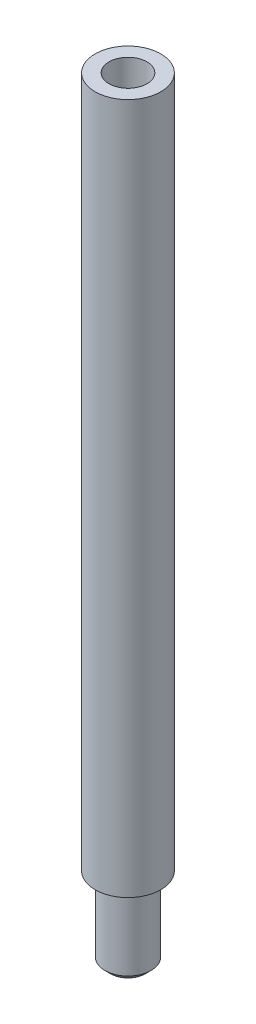
ISO-10303-21;
HEADER;
FILE_DESCRIPTION(('STEP AP214'),'2;1');
FILE_NAME('part.step','',(''),(''),'','','');
FILE_SCHEMA(('AUTOMOTIVE_DESIGN { 1 0 10303 214 1 1 1 1 }'));
ENDSEC;
DATA;
#1=APPLICATION_CONTEXT('core data for automotive mechanical design processes');
#2=APPLICATION_PROTOCOL_DEFINITION('international standard','automotive_design',2000,#1);
#3=PRODUCT_CONTEXT('',#1,'mechanical');
#4=PRODUCT('Part','Part','',(#3));
#5=PRODUCT_RELATED_PRODUCT_CATEGORY('part','',(#4));
#6=PRODUCT_DEFINITION_FORMATION('','',#4);
#7=PRODUCT_DEFINITION_CONTEXT('part definition',#1,'design');
#8=PRODUCT_DEFINITION('design','',#6,#7);
#9=PRODUCT_DEFINITION_SHAPE('','',#8);
#10=(LENGTH_UNIT() NAMED_UNIT(*) SI_UNIT(.MILLI.,.METRE.));
#11=(NAMED_UNIT(*) PLANE_ANGLE_UNIT() SI_UNIT($,.RADIAN.));
#12=(NAMED_UNIT(*) SI_UNIT($,.STERADIAN.) SOLID_ANGLE_UNIT());
#13=UNCERTAINTY_MEASURE_WITH_UNIT(LENGTH_MEASURE(1.E-05),#10,'distance_accuracy_value','');
#14=(GEOMETRIC_REPRESENTATION_CONTEXT(3) GLOBAL_UNCERTAINTY_ASSIGNED_CONTEXT((#13)) GLOBAL_UNIT_ASSIGNED_CONTEXT((#10,
#11,#12)) REPRESENTATION_CONTEXT('',''));
#15=CARTESIAN_POINT('',(0.,0.,0.));
#16=DIRECTION('',(0.,0.,1.));
#17=DIRECTION('',(1.,0.,0.));
#18=AXIS2_PLACEMENT_3D('',#15,#16,#17);
#19=CARTESIAN_POINT('',(0.,60.,0.));
#20=DIRECTION('',(0.,-1.,0.));
#21=DIRECTION('',(0.,0.,-1.));
#22=AXIS2_PLACEMENT_3D('',#19,#20,#21);
#23=CYLINDRICAL_SURFACE('',#22,2.85);
#24=CARTESIAN_POINT('',(0.,60.,0.));
#25=DIRECTION('',(0.,1.,0.));
#26=DIRECTION('',(0.,0.,1.));
#27=AXIS2_PLACEMENT_3D('',#24,#25,#26);
#28=CIRCLE('',#27,2.85);
#29=CARTESIAN_POINT('',(0.,60.,2.85));
#30=VERTEX_POINT('',#29);
#31=EDGE_CURVE('E65',#30,#30,#28,.T.);
#32=ORIENTED_EDGE('',*,*,#31,.F.);
#33=EDGE_LOOP('',(#32));
#34=FACE_BOUND('',#33,.T.);
#35=CARTESIAN_POINT('',(0.,0.,0.));
#36=DIRECTION('',(0.,1.,0.));
#37=DIRECTION('',(0.,0.,1.));
#38=AXIS2_PLACEMENT_3D('',#35,#36,#37);
#39=CIRCLE('',#38,2.85);
#40=CARTESIAN_POINT('',(0.,0.,2.85));
#41=VERTEX_POINT('',#40);
#42=EDGE_CURVE('E60',#41,#41,#39,.T.);
#43=ORIENTED_EDGE('',*,*,#42,.T.);
#44=EDGE_LOOP('',(#43));
#45=FACE_BOUND('',#44,.T.);
#46=ADVANCED_FACE('F36',(#34,#45),#23,.T.);
#47=CARTESIAN_POINT('',(0.,60.,0.));
#48=DIRECTION('',(0.,1.,0.));
#49=DIRECTION('',(0.,0.,1.));
#50=AXIS2_PLACEMENT_3D('',#47,#48,#49);
#51=PLANE('',#50);
#52=CARTESIAN_POINT('',(0.,60.,0.));
#53=DIRECTION('',(0.,1.,0.));
#54=DIRECTION('',(0.,0.,1.));
#55=AXIS2_PLACEMENT_3D('',#52,#53,#54);
#56=CIRCLE('',#55,1.64999999999999);
#57=CARTESIAN_POINT('',(0.,60.,1.64999999999999));
#58=VERTEX_POINT('',#57);
#59=EDGE_CURVE('E57',#58,#58,#56,.T.);
#60=ORIENTED_EDGE('',*,*,#59,.F.);
#61=EDGE_LOOP('',(#60));
#62=FACE_BOUND('',#61,.T.);
#63=ORIENTED_EDGE('',*,*,#31,.T.);
#64=EDGE_LOOP('',(#63));
#65=FACE_BOUND('',#64,.T.);
#66=ADVANCED_FACE('F83',(#62,#65),#51,.T.);
#67=CARTESIAN_POINT('',(0.,0.,0.));
#68=DIRECTION('',(0.,1.,0.));
#69=DIRECTION('',(0.,0.,1.));
#70=AXIS2_PLACEMENT_3D('',#67,#68,#69);
#71=PLANE('',#70);
#72=CARTESIAN_POINT('',(0.,0.,0.));
#73=DIRECTION('',(0.,1.,0.));
#74=DIRECTION('',(0.,0.,1.));
#75=AXIS2_PLACEMENT_3D('',#72,#73,#74);
#76=CIRCLE('',#75,2.);
#77=CARTESIAN_POINT('',(0.,0.,2.));
#78=VERTEX_POINT('',#77);
#79=EDGE_CURVE('E56',#78,#78,#76,.T.);
#80=ORIENTED_EDGE('',*,*,#79,.T.);
#81=EDGE_LOOP('',(#80));
#82=FACE_BOUND('',#81,.T.);
#83=ORIENTED_EDGE('',*,*,#42,.F.);
#84=EDGE_LOOP('',(#83));
#85=FACE_BOUND('',#84,.T.);
#86=ADVANCED_FACE('F88',(#82,#85),#71,.F.);
#87=CARTESIAN_POINT('',(0.,-7.,0.));
#88=DIRECTION('',(0.,1.,0.));
#89=DIRECTION('',(0.,0.,1.));
#90=AXIS2_PLACEMENT_3D('',#87,#88,#89);
#91=CYLINDRICAL_SURFACE('',#90,2.);
#92=CARTESIAN_POINT('',(0.,-6.49999999999999,0.));
#93=DIRECTION('',(0.,1.,0.));
#94=DIRECTION('',(0.,0.,1.));
#95=AXIS2_PLACEMENT_3D('',#92,#93,#94);
#96=CIRCLE('',#95,2.);
#97=CARTESIAN_POINT('',(0.,-6.49999999999999,2.));
#98=VERTEX_POINT('',#97);
#99=EDGE_CURVE('E43',#98,#98,#96,.T.);
#100=ORIENTED_EDGE('',*,*,#99,.T.);
#101=EDGE_LOOP('',(#100));
#102=FACE_BOUND('',#101,.T.);
#103=ORIENTED_EDGE('',*,*,#79,.F.);
#104=EDGE_LOOP('',(#103));
#105=FACE_BOUND('',#104,.T.);
#106=ADVANCED_FACE('F72',(#102,#105),#91,.T.);
#107=CARTESIAN_POINT('',(0.,-7.,0.));
#108=DIRECTION('',(0.,1.,0.));
#109=DIRECTION('',(0.,0.,1.));
#110=AXIS2_PLACEMENT_3D('',#107,#108,#109);
#111=PLANE('',#110);
#112=CARTESIAN_POINT('',(0.,-7.,0.));
#113=DIRECTION('',(0.,1.,0.));
#114=DIRECTION('',(0.,0.,1.));
#115=AXIS2_PLACEMENT_3D('',#112,#113,#114);
#116=CIRCLE('',#115,1.49999999999999);
#117=CARTESIAN_POINT('',(0.,-7.,1.49999999999999));
#118=VERTEX_POINT('',#117);
#119=EDGE_CURVE('E11',#118,#118,#116,.F.);
#120=ORIENTED_EDGE('',*,*,#119,.T.);
#121=EDGE_LOOP('',(#120));
#122=FACE_BOUND('',#121,.T.);
#123=ADVANCED_FACE('F50',(#122),#111,.F.);
#124=CARTESIAN_POINT('',(0.,49.9,0.));
#125=DIRECTION('',(0.,1.,0.));
#126=DIRECTION('',(0.,0.,1.));
#127=AXIS2_PLACEMENT_3D('',#124,#125,#126);
#128=CONICAL_SURFACE('',#127,1.65,1.02974425867665);
#129=CARTESIAN_POINT('',(0.,48.9085799786045,0.));
#130=VERTEX_POINT('',#129);
#131=VERTEX_LOOP('',#130);
#132=FACE_BOUND('',#131,.T.);
#133=CARTESIAN_POINT('',(0.,49.9,0.));
#134=DIRECTION('',(0.,1.,0.));
#135=DIRECTION('',(0.,0.,1.));
#136=AXIS2_PLACEMENT_3D('',#133,#134,#135);
#137=CIRCLE('',#136,1.65);
#138=CARTESIAN_POINT('',(0.,49.9,1.65));
#139=VERTEX_POINT('',#138);
#140=EDGE_CURVE('E54',#139,#139,#137,.T.);
#141=ORIENTED_EDGE('',*,*,#140,.T.);
#142=EDGE_LOOP('',(#141));
#143=FACE_BOUND('',#142,.T.);
#144=ADVANCED_FACE('F46',(#132,#143),#128,.F.);
#145=CARTESIAN_POINT('',(0.,60.,0.));
#146=DIRECTION('',(0.,1.,0.));
#147=DIRECTION('',(0.,0.,1.));
#148=AXIS2_PLACEMENT_3D('',#145,#146,#147);
#149=CYLINDRICAL_SURFACE('',#148,1.64999999999999);
#150=ORIENTED_EDGE('',*,*,#140,.F.);
#151=EDGE_LOOP('',(#150));
#152=FACE_BOUND('',#151,.T.);
#153=ORIENTED_EDGE('',*,*,#59,.T.);
#154=EDGE_LOOP('',(#153));
#155=FACE_BOUND('',#154,.T.);
#156=ADVANCED_FACE('F49',(#152,#155),#149,.F.);
#157=CARTESIAN_POINT('',(0.,-6.49999999999999,0.));
#158=DIRECTION('',(0.,1.,0.));
#159=DIRECTION('',(0.,0.,1.));
#160=AXIS2_PLACEMENT_3D('',#157,#158,#159);
#161=CONICAL_SURFACE('',#160,2.,0.785398163397448);
#162=ORIENTED_EDGE('',*,*,#119,.F.);
#163=EDGE_LOOP('',(#162));
#164=FACE_BOUND('',#163,.T.);
#165=ORIENTED_EDGE('',*,*,#99,.F.);
#166=EDGE_LOOP('',(#165));
#167=FACE_BOUND('',#166,.T.);
#168=ADVANCED_FACE('F38',(#164,#167),#161,.T.);
#169=CLOSED_SHELL('',(#46,#66,#86,#106,#123,#144,#156,#168));
#170=MANIFOLD_SOLID_BREP('B2',#169);
#171=ADVANCED_BREP_SHAPE_REPRESENTATION('',(#18,#170),#14);
#172=SHAPE_DEFINITION_REPRESENTATION(#9,#171);
ENDSEC;
END-ISO-10303-21;
